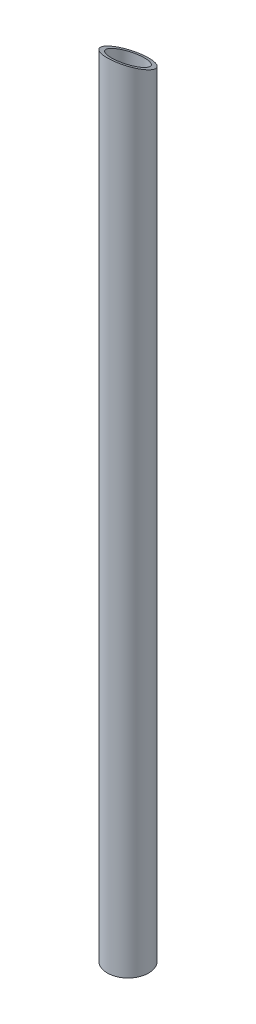
ISO-10303-21;
HEADER;
FILE_DESCRIPTION(('STEP AP214'),'2;1');
FILE_NAME('part.step','',(''),(''),'','','');
FILE_SCHEMA(('AUTOMOTIVE_DESIGN { 1 0 10303 214 1 1 1 1 }'));
ENDSEC;
DATA;
#1=APPLICATION_CONTEXT('core data for automotive mechanical design processes');
#2=APPLICATION_PROTOCOL_DEFINITION('international standard','automotive_design',2000,#1);
#3=PRODUCT_CONTEXT('',#1,'mechanical');
#4=PRODUCT('Part','Part','',(#3));
#5=PRODUCT_RELATED_PRODUCT_CATEGORY('part','',(#4));
#6=PRODUCT_DEFINITION_FORMATION('','',#4);
#7=PRODUCT_DEFINITION_CONTEXT('part definition',#1,'design');
#8=PRODUCT_DEFINITION('design','',#6,#7);
#9=PRODUCT_DEFINITION_SHAPE('','',#8);
#10=(LENGTH_UNIT() NAMED_UNIT(*) SI_UNIT(.MILLI.,.METRE.));
#11=(NAMED_UNIT(*) PLANE_ANGLE_UNIT() SI_UNIT($,.RADIAN.));
#12=(NAMED_UNIT(*) SI_UNIT($,.STERADIAN.) SOLID_ANGLE_UNIT());
#13=UNCERTAINTY_MEASURE_WITH_UNIT(LENGTH_MEASURE(1.E-05),#10,'distance_accuracy_value','');
#14=(GEOMETRIC_REPRESENTATION_CONTEXT(3) GLOBAL_UNCERTAINTY_ASSIGNED_CONTEXT((#13)) GLOBAL_UNIT_ASSIGNED_CONTEXT((#10,
#11,#12)) REPRESENTATION_CONTEXT('',''));
#15=CARTESIAN_POINT('',(0.,0.,0.));
#16=DIRECTION('',(0.,0.,1.));
#17=DIRECTION('',(1.,0.,0.));
#18=AXIS2_PLACEMENT_3D('',#15,#16,#17);
#19=CARTESIAN_POINT('',(0.,609.6,0.));
#20=DIRECTION('',(0.,-1.,0.));
#21=DIRECTION('',(0.,0.,-1.));
#22=AXIS2_PLACEMENT_3D('',#19,#20,#21);
#23=CYLINDRICAL_SURFACE('',#22,15.9);
#24=CARTESIAN_POINT('',(0.,0.,0.));
#25=DIRECTION('',(0.,1.,0.));
#26=DIRECTION('',(0.,0.,1.));
#27=AXIS2_PLACEMENT_3D('',#24,#25,#26);
#28=CIRCLE('',#27,15.9);
#29=CARTESIAN_POINT('',(0.,0.,15.9));
#30=VERTEX_POINT('',#29);
#31=EDGE_CURVE('E10',#30,#30,#28,.T.);
#32=ORIENTED_EDGE('',*,*,#31,.T.);
#33=EDGE_LOOP('',(#32));
#34=FACE_BOUND('',#33,.T.);
#35=CARTESIAN_POINT('',(0.,601.65,0.));
#36=DIRECTION('',(0.,-0.894427190999916,0.447213595499959));
#37=DIRECTION('',(0.,-0.447213595499959,-0.894427190999916));
#38=AXIS2_PLACEMENT_3D('',#35,#36,#37);
#39=ELLIPSE('',#38,17.7767404211233,15.9);
#40=CARTESIAN_POINT('',(0.,593.7,-15.9));
#41=VERTEX_POINT('',#40);
#42=EDGE_CURVE('E40',#41,#41,#39,.T.);
#43=ORIENTED_EDGE('',*,*,#42,.T.);
#44=EDGE_LOOP('',(#43));
#45=FACE_BOUND('',#44,.T.);
#46=ADVANCED_FACE('F29',(#34,#45),#23,.T.);
#47=CARTESIAN_POINT('',(0.,0.,0.));
#48=DIRECTION('',(0.,1.,0.));
#49=DIRECTION('',(0.,0.,1.));
#50=AXIS2_PLACEMENT_3D('',#47,#48,#49);
#51=PLANE('',#50);
#52=ORIENTED_EDGE('',*,*,#31,.F.);
#53=EDGE_LOOP('',(#52));
#54=FACE_BOUND('',#53,.T.);
#55=CARTESIAN_POINT('',(0.,0.,0.));
#56=DIRECTION('',(0.,1.,0.));
#57=DIRECTION('',(0.,0.,1.));
#58=AXIS2_PLACEMENT_3D('',#55,#56,#57);
#59=CIRCLE('',#58,12.725);
#60=CARTESIAN_POINT('',(0.,0.,12.725));
#61=VERTEX_POINT('',#60);
#62=EDGE_CURVE('E36',#61,#61,#59,.T.);
#63=ORIENTED_EDGE('',*,*,#62,.T.);
#64=EDGE_LOOP('',(#63));
#65=FACE_BOUND('',#64,.T.);
#66=ADVANCED_FACE('F55',(#54,#65),#51,.F.);
#67=CARTESIAN_POINT('',(0.,609.6,0.));
#68=DIRECTION('',(0.,-1.,0.));
#69=DIRECTION('',(0.,0.,-1.));
#70=AXIS2_PLACEMENT_3D('',#67,#68,#69);
#71=CYLINDRICAL_SURFACE('',#70,12.725);
#72=CARTESIAN_POINT('',(0.,601.65,0.));
#73=DIRECTION('',(0.,-0.894427190999916,0.447213595499959));
#74=DIRECTION('',(0.,-0.447213595499959,-0.894427190999916));
#75=AXIS2_PLACEMENT_3D('',#72,#73,#74);
#76=ELLIPSE('',#75,14.2269825068424,12.725);
#77=CARTESIAN_POINT('',(0.,595.2875,-12.725));
#78=VERTEX_POINT('',#77);
#79=EDGE_CURVE('E32',#78,#78,#76,.T.);
#80=ORIENTED_EDGE('',*,*,#79,.F.);
#81=EDGE_LOOP('',(#80));
#82=FACE_BOUND('',#81,.T.);
#83=ORIENTED_EDGE('',*,*,#62,.F.);
#84=EDGE_LOOP('',(#83));
#85=FACE_BOUND('',#84,.T.);
#86=ADVANCED_FACE('F52',(#82,#85),#71,.F.);
#87=CARTESIAN_POINT('',(-15.9,609.6,15.9));
#88=DIRECTION('',(0.,-0.894427190999916,0.447213595499959));
#89=DIRECTION('',(0.,-0.447213595499959,-0.894427190999916));
#90=AXIS2_PLACEMENT_3D('',#87,#88,#89);
#91=PLANE('',#90);
#92=ORIENTED_EDGE('',*,*,#79,.T.);
#93=EDGE_LOOP('',(#92));
#94=FACE_BOUND('',#93,.T.);
#95=ORIENTED_EDGE('',*,*,#42,.F.);
#96=EDGE_LOOP('',(#95));
#97=FACE_BOUND('',#96,.T.);
#98=ADVANCED_FACE('F49',(#94,#97),#91,.F.);
#99=CLOSED_SHELL('',(#46,#66,#86,#98));
#100=MANIFOLD_SOLID_BREP('B2',#99);
#101=ADVANCED_BREP_SHAPE_REPRESENTATION('',(#18,#100),#14);
#102=SHAPE_DEFINITION_REPRESENTATION(#9,#101);
ENDSEC;
END-ISO-10303-21;
